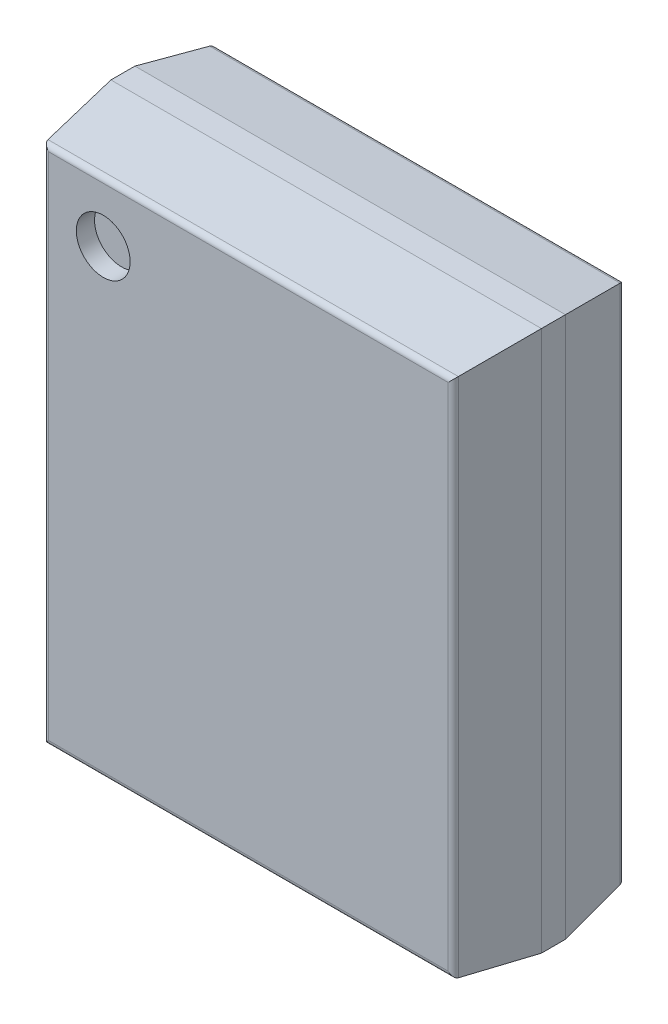
ISO-10303-21;
HEADER;
FILE_DESCRIPTION(('STEP AP214'),'2;1');
FILE_NAME('part.step','',(''),(''),'','','');
FILE_SCHEMA(('AUTOMOTIVE_DESIGN { 1 0 10303 214 1 1 1 1 }'));
ENDSEC;
DATA;
#1=APPLICATION_CONTEXT('core data for automotive mechanical design processes');
#2=APPLICATION_PROTOCOL_DEFINITION('international standard','automotive_design',2000,#1);
#3=PRODUCT_CONTEXT('',#1,'mechanical');
#4=PRODUCT('Part','Part','',(#3));
#5=PRODUCT_RELATED_PRODUCT_CATEGORY('part','',(#4));
#6=PRODUCT_DEFINITION_FORMATION('','',#4);
#7=PRODUCT_DEFINITION_CONTEXT('part definition',#1,'design');
#8=PRODUCT_DEFINITION('design','',#6,#7);
#9=PRODUCT_DEFINITION_SHAPE('','',#8);
#10=(LENGTH_UNIT() NAMED_UNIT(*) SI_UNIT(.MILLI.,.METRE.));
#11=(NAMED_UNIT(*) PLANE_ANGLE_UNIT() SI_UNIT($,.RADIAN.));
#12=(NAMED_UNIT(*) SI_UNIT($,.STERADIAN.) SOLID_ANGLE_UNIT());
#13=UNCERTAINTY_MEASURE_WITH_UNIT(LENGTH_MEASURE(1.E-05),#10,'distance_accuracy_value','');
#14=(GEOMETRIC_REPRESENTATION_CONTEXT(3) GLOBAL_UNCERTAINTY_ASSIGNED_CONTEXT((#13)) GLOBAL_UNIT_ASSIGNED_CONTEXT((#10,
#11,#12)) REPRESENTATION_CONTEXT('',''));
#15=CARTESIAN_POINT('',(0.,0.,0.));
#16=DIRECTION('',(0.,0.,1.));
#17=DIRECTION('',(1.,0.,0.));
#18=AXIS2_PLACEMENT_3D('',#15,#16,#17);
#19=CARTESIAN_POINT('',(-1.315,1.815,1.485));
#20=DIRECTION('',(0.,0.,1.));
#21=DIRECTION('',(1.,0.,0.));
#22=AXIS2_PLACEMENT_3D('',#19,#20,#21);
#23=PLANE('',#22);
#24=CARTESIAN_POINT('',(-1.315,1.815,1.485));
#25=DIRECTION('',(0.,0.,1.));
#26=DIRECTION('',(1.,0.,0.));
#27=AXIS2_PLACEMENT_3D('',#24,#25,#26);
#28=CIRCLE('',#27,0.24375);
#29=CARTESIAN_POINT('',(-1.07125,1.815,1.485));
#30=VERTEX_POINT('',#29);
#31=EDGE_CURVE('E11',#30,#30,#28,.T.);
#32=ORIENTED_EDGE('',*,*,#31,.T.);
#33=EDGE_LOOP('',(#32));
#34=FACE_BOUND('',#33,.T.);
#35=ADVANCED_FACE('F17',(#34),#23,.T.);
#36=CARTESIAN_POINT('',(-1.315,1.815,1.485));
#37=DIRECTION('',(0.,0.,1.));
#38=DIRECTION('',(1.,0.,0.));
#39=AXIS2_PLACEMENT_3D('',#36,#37,#38);
#40=CYLINDRICAL_SURFACE('',#39,0.24375);
#41=DIRECTION('',(0.,0.,1.));
#42=VECTOR('',#41,1.);
#43=CARTESIAN_POINT('',(-1.07125,1.815,1.485));
#44=LINE('',#43,#42);
#45=CARTESIAN_POINT('',(-1.07125,1.815,1.65));
#46=VERTEX_POINT('',#45);
#47=EDGE_CURVE('E20',#30,#46,#44,.T.);
#48=ORIENTED_EDGE('',*,*,#47,.T.);
#49=CARTESIAN_POINT('',(-1.315,1.815,1.65));
#50=DIRECTION('',(0.,0.,1.));
#51=DIRECTION('',(1.,0.,0.));
#52=AXIS2_PLACEMENT_3D('',#49,#50,#51);
#53=CIRCLE('',#52,0.24375);
#54=EDGE_CURVE('E199',#46,#46,#53,.T.);
#55=ORIENTED_EDGE('',*,*,#54,.T.);
#56=ORIENTED_EDGE('',*,*,#47,.F.);
#57=ORIENTED_EDGE('',*,*,#31,.F.);
#58=EDGE_LOOP('',(#48,#55,#56,#57));
#59=FACE_BOUND('',#58,.T.);
#60=ADVANCED_FACE('F394',(#59),#40,.F.);
#61=CARTESIAN_POINT('',(1.808944484583,-2.3525,1.6));
#62=DIRECTION('',(0.,1.,0.));
#63=DIRECTION('',(0.,0.,1.));
#64=AXIS2_PLACEMENT_3D('',#61,#62,#63);
#65=CYLINDRICAL_SURFACE('',#64,0.05);
#66=CARTESIAN_POINT('',(1.808944484583,-2.308944484583,1.6));
#67=DIRECTION('',(-0.707106781186548,-0.707106781186548,0.));
#68=DIRECTION('',(0.707106781186548,-0.707106781186548,0.));
#69=AXIS2_PLACEMENT_3D('',#66,#67,#68);
#70=ELLIPSE('',#69,0.07071067811865,0.05);
#71=CARTESIAN_POINT('',(1.85847222397,-2.35847222397,1.606855875671));
#72=VERTEX_POINT('',#71);
#73=CARTESIAN_POINT('',(1.808944484583,-2.308944484583,1.65));
#74=VERTEX_POINT('',#73);
#75=EDGE_CURVE('E297',#72,#74,#70,.T.);
#76=ORIENTED_EDGE('',*,*,#75,.F.);
#77=DIRECTION('',(0.,1.,0.));
#78=VECTOR('',#77,1.);
#79=CARTESIAN_POINT('',(1.85847222397,-2.3525,1.606855875671));
#80=LINE('',#79,#78);
#81=CARTESIAN_POINT('',(1.85847222397,2.35847222397,1.606855875671));
#82=VERTEX_POINT('',#81);
#83=EDGE_CURVE('E293',#72,#82,#80,.T.);
#84=ORIENTED_EDGE('',*,*,#83,.T.);
#85=CARTESIAN_POINT('',(1.808944484583,2.308944484583,1.6));
#86=DIRECTION('',(-0.707106781186548,0.707106781186548,0.));
#87=DIRECTION('',(0.707106781186548,0.707106781186548,0.));
#88=AXIS2_PLACEMENT_3D('',#85,#86,#87);
#89=ELLIPSE('',#88,0.07071067811865,0.05);
#90=CARTESIAN_POINT('',(1.808944484583,2.308944484583,1.65));
#91=VERTEX_POINT('',#90);
#92=EDGE_CURVE('E202',#91,#82,#89,.T.);
#93=ORIENTED_EDGE('',*,*,#92,.F.);
#94=DIRECTION('',(0.,1.,0.));
#95=VECTOR('',#94,1.);
#96=CARTESIAN_POINT('',(1.808944484583,-2.3525,1.65));
#97=LINE('',#96,#95);
#98=EDGE_CURVE('E305',#74,#91,#97,.T.);
#99=ORIENTED_EDGE('',*,*,#98,.F.);
#100=EDGE_LOOP('',(#76,#84,#93,#99));
#101=FACE_BOUND('',#100,.T.);
#102=ADVANCED_FACE('F319',(#101),#65,.T.);
#103=CARTESIAN_POINT('',(-1.8525,2.308944484583,1.6));
#104=DIRECTION('',(1.,0.,0.));
#105=DIRECTION('',(0.,0.,1.));
#106=AXIS2_PLACEMENT_3D('',#103,#104,#105);
#107=CYLINDRICAL_SURFACE('',#106,0.05);
#108=DIRECTION('',(1.,0.,0.));
#109=VECTOR('',#108,1.);
#110=CARTESIAN_POINT('',(-1.8525,2.308944484583,1.65));
#111=LINE('',#110,#109);
#112=CARTESIAN_POINT('',(-1.808944484583,2.308944484583,1.65));
#113=VERTEX_POINT('',#112);
#114=EDGE_CURVE('E203',#113,#91,#111,.T.);
#115=ORIENTED_EDGE('',*,*,#114,.T.);
#116=ORIENTED_EDGE('',*,*,#92,.T.);
#117=DIRECTION('',(1.,0.,0.));
#118=VECTOR('',#117,1.);
#119=CARTESIAN_POINT('',(-1.8525,2.35847222397,1.606855875671));
#120=LINE('',#119,#118);
#121=CARTESIAN_POINT('',(-1.85847222397,2.35847222397,1.606855875671));
#122=VERTEX_POINT('',#121);
#123=EDGE_CURVE('E288',#122,#82,#120,.T.);
#124=ORIENTED_EDGE('',*,*,#123,.F.);
#125=CARTESIAN_POINT('',(-1.808944484583,2.308944484583,1.6));
#126=DIRECTION('',(0.707106781186548,0.707106781186548,0.));
#127=DIRECTION('',(-0.707106781186548,0.707106781186548,0.));
#128=AXIS2_PLACEMENT_3D('',#125,#126,#127);
#129=ELLIPSE('',#128,0.07071067811865,0.05);
#130=EDGE_CURVE('E283',#122,#113,#129,.T.);
#131=ORIENTED_EDGE('',*,*,#130,.T.);
#132=EDGE_LOOP('',(#115,#116,#124,#131));
#133=FACE_BOUND('',#132,.T.);
#134=ADVANCED_FACE('F313',(#133),#107,.T.);
#135=CARTESIAN_POINT('',(-1.95,-2.45,1.65));
#136=DIRECTION('',(0.,0.,1.));
#137=DIRECTION('',(1.,0.,0.));
#138=AXIS2_PLACEMENT_3D('',#135,#136,#137);
#139=PLANE('',#138);
#140=ORIENTED_EDGE('',*,*,#54,.F.);
#141=EDGE_LOOP('',(#140));
#142=FACE_BOUND('',#141,.T.);
#143=DIRECTION('',(0.,1.,0.));
#144=VECTOR('',#143,1.);
#145=CARTESIAN_POINT('',(-1.808944484583,-2.3525,1.65));
#146=LINE('',#145,#144);
#147=CARTESIAN_POINT('',(-1.808944484583,-2.308944484583,1.65));
#148=VERTEX_POINT('',#147);
#149=EDGE_CURVE('E280',#148,#113,#146,.T.);
#150=ORIENTED_EDGE('',*,*,#149,.F.);
#151=DIRECTION('',(1.,0.,0.));
#152=VECTOR('',#151,1.);
#153=CARTESIAN_POINT('',(-1.8525,-2.308944484583,1.65));
#154=LINE('',#153,#152);
#155=EDGE_CURVE('E301',#148,#74,#154,.T.);
#156=ORIENTED_EDGE('',*,*,#155,.T.);
#157=ORIENTED_EDGE('',*,*,#98,.T.);
#158=ORIENTED_EDGE('',*,*,#114,.F.);
#159=EDGE_LOOP('',(#150,#156,#157,#158));
#160=FACE_BOUND('',#159,.T.);
#161=ADVANCED_FACE('F317',(#142,#160),#139,.T.);
#162=CARTESIAN_POINT('',(-1.8525,-2.308944484583,1.6));
#163=DIRECTION('',(1.,0.,0.));
#164=DIRECTION('',(0.,-0.990554787738321,0.137117513428044));
#165=AXIS2_PLACEMENT_3D('',#162,#163,#164);
#166=CYLINDRICAL_SURFACE('',#165,0.05);
#167=DIRECTION('',(1.,0.,0.));
#168=VECTOR('',#167,1.);
#169=CARTESIAN_POINT('',(-1.8525,-2.35847222397,1.606855875671));
#170=LINE('',#169,#168);
#171=CARTESIAN_POINT('',(-1.85847222397,-2.35847222397,1.606855875671));
#172=VERTEX_POINT('',#171);
#173=EDGE_CURVE('E225',#172,#72,#170,.T.);
#174=ORIENTED_EDGE('',*,*,#173,.T.);
#175=ORIENTED_EDGE('',*,*,#75,.T.);
#176=ORIENTED_EDGE('',*,*,#155,.F.);
#177=CARTESIAN_POINT('',(-1.808944484583,-2.308944484583,1.6));
#178=DIRECTION('',(-0.707106781186548,0.707106781186548,0.));
#179=DIRECTION('',(0.707106781186548,0.707106781186548,0.));
#180=AXIS2_PLACEMENT_3D('',#177,#178,#179);
#181=ELLIPSE('',#180,0.07071067811865,0.05);
#182=EDGE_CURVE('E229',#172,#148,#181,.T.);
#183=ORIENTED_EDGE('',*,*,#182,.F.);
#184=EDGE_LOOP('',(#174,#175,#176,#183));
#185=FACE_BOUND('',#184,.T.);
#186=ADVANCED_FACE('F328',(#185),#166,.T.);
#187=CARTESIAN_POINT('',(1.90125,-2.45,1.297823646339));
#188=DIRECTION('',(0.990554787738321,0.,0.137117513428044));
#189=DIRECTION('',(0.,-1.,0.));
#190=AXIS2_PLACEMENT_3D('',#187,#188,#189);
#191=PLANE('',#190);
#192=DIRECTION('',(-0.135846421408054,0.135846421408054,0.98137225331739));
#193=VECTOR('',#192,1.);
#194=CARTESIAN_POINT('',(1.86616385679,-2.36616385679,1.551290517721));
#195=LINE('',#194,#193);
#196=CARTESIAN_POINT('',(1.95,-2.45,0.945647292679));
#197=VERTEX_POINT('',#196);
#198=EDGE_CURVE('E230',#197,#72,#195,.T.);
#199=ORIENTED_EDGE('',*,*,#198,.F.);
#200=DIRECTION('',(0.,1.,0.));
#201=VECTOR('',#200,1.);
#202=CARTESIAN_POINT('',(1.95,-2.45,0.945647292679));
#203=LINE('',#202,#201);
#204=CARTESIAN_POINT('',(1.95,2.45,0.945647292679));
#205=VERTEX_POINT('',#204);
#206=EDGE_CURVE('E154',#197,#205,#203,.T.);
#207=ORIENTED_EDGE('',*,*,#206,.T.);
#208=DIRECTION('',(-0.135846421408054,-0.135846421408054,0.98137225331739));
#209=VECTOR('',#208,1.);
#210=CARTESIAN_POINT('',(1.820950943777,2.320950943777,1.877914493992));
#211=LINE('',#210,#209);
#212=EDGE_CURVE('E148',#205,#82,#211,.T.);
#213=ORIENTED_EDGE('',*,*,#212,.T.);
#214=ORIENTED_EDGE('',*,*,#83,.F.);
#215=EDGE_LOOP('',(#199,#207,#213,#214));
#216=FACE_BOUND('',#215,.T.);
#217=ADVANCED_FACE('F322',(#216),#191,.T.);
#218=CARTESIAN_POINT('',(-1.95,2.40125,1.297823646339));
#219=DIRECTION('',(0.,0.990554787738321,0.137117513428044));
#220=DIRECTION('',(1.,0.,0.));
#221=AXIS2_PLACEMENT_3D('',#218,#219,#220);
#222=PLANE('',#221);
#223=ORIENTED_EDGE('',*,*,#123,.T.);
#224=ORIENTED_EDGE('',*,*,#212,.F.);
#225=DIRECTION('',(1.,0.,0.));
#226=VECTOR('',#225,1.);
#227=CARTESIAN_POINT('',(-1.95,2.45,0.945647292679));
#228=LINE('',#227,#226);
#229=CARTESIAN_POINT('',(-1.95,2.45,0.945647292679));
#230=VERTEX_POINT('',#229);
#231=EDGE_CURVE('E141',#230,#205,#228,.T.);
#232=ORIENTED_EDGE('',*,*,#231,.F.);
#233=DIRECTION('',(0.135846421408054,-0.135846421408054,0.98137225331739));
#234=VECTOR('',#233,1.);
#235=CARTESIAN_POINT('',(-1.856936731685,2.356936731685,1.617948472062));
#236=LINE('',#235,#234);
#237=EDGE_CURVE('E145',#230,#122,#236,.T.);
#238=ORIENTED_EDGE('',*,*,#237,.T.);
#239=EDGE_LOOP('',(#223,#224,#232,#238));
#240=FACE_BOUND('',#239,.T.);
#241=ADVANCED_FACE('F144',(#240),#222,.T.);
#242=CARTESIAN_POINT('',(-1.808944484583,-2.3525,1.6));
#243=DIRECTION('',(0.,1.,0.));
#244=DIRECTION('',(-0.990554787738321,0.,0.137117513428044));
#245=AXIS2_PLACEMENT_3D('',#242,#243,#244);
#246=CYLINDRICAL_SURFACE('',#245,0.05);
#247=ORIENTED_EDGE('',*,*,#182,.T.);
#248=ORIENTED_EDGE('',*,*,#149,.T.);
#249=ORIENTED_EDGE('',*,*,#130,.F.);
#250=DIRECTION('',(0.,1.,0.));
#251=VECTOR('',#250,1.);
#252=CARTESIAN_POINT('',(-1.85847222397,-2.3525,1.606855875671));
#253=LINE('',#252,#251);
#254=EDGE_CURVE('E164',#172,#122,#253,.T.);
#255=ORIENTED_EDGE('',*,*,#254,.F.);
#256=EDGE_LOOP('',(#247,#248,#249,#255));
#257=FACE_BOUND('',#256,.T.);
#258=ADVANCED_FACE('F325',(#257),#246,.T.);
#259=CARTESIAN_POINT('',(-1.95,-2.40125,1.297823646339));
#260=DIRECTION('',(0.,0.990554787738321,-0.137117513428044));
#261=DIRECTION('',(-1.,0.,0.));
#262=AXIS2_PLACEMENT_3D('',#259,#260,#261);
#263=PLANE('',#262);
#264=DIRECTION('',(0.135846421408054,0.135846421408054,0.98137225331739));
#265=VECTOR('',#264,1.);
#266=CARTESIAN_POINT('',(-1.902149644698,-2.402149644698,1.291324495791));
#267=LINE('',#266,#265);
#268=CARTESIAN_POINT('',(-1.95,-2.45,0.945647292679));
#269=VERTEX_POINT('',#268);
#270=EDGE_CURVE('E166',#269,#172,#267,.T.);
#271=ORIENTED_EDGE('',*,*,#270,.F.);
#272=DIRECTION('',(1.,0.,0.));
#273=VECTOR('',#272,1.);
#274=CARTESIAN_POINT('',(-1.95,-2.45,0.945647292679));
#275=LINE('',#274,#273);
#276=EDGE_CURVE('E254',#269,#197,#275,.T.);
#277=ORIENTED_EDGE('',*,*,#276,.T.);
#278=ORIENTED_EDGE('',*,*,#198,.T.);
#279=ORIENTED_EDGE('',*,*,#173,.F.);
#280=EDGE_LOOP('',(#271,#277,#278,#279));
#281=FACE_BOUND('',#280,.T.);
#282=ADVANCED_FACE('F330',(#281),#263,.F.);
#283=CARTESIAN_POINT('',(1.95,-2.45,0.1));
#284=DIRECTION('',(1.,0.,0.));
#285=DIRECTION('',(0.,1.,0.));
#286=AXIS2_PLACEMENT_3D('',#283,#284,#285);
#287=PLANE('',#286);
#288=DIRECTION('',(0.,0.,1.));
#289=VECTOR('',#288,1.);
#290=CARTESIAN_POINT('',(1.95,-2.45,0.1));
#291=LINE('',#290,#289);
#292=CARTESIAN_POINT('',(1.95,-2.45,0.728147292679));
#293=VERTEX_POINT('',#292);
#294=EDGE_CURVE('E218',#293,#197,#291,.T.);
#295=ORIENTED_EDGE('',*,*,#294,.F.);
#296=DIRECTION('',(0.,1.,0.));
#297=VECTOR('',#296,1.);
#298=CARTESIAN_POINT('',(1.95,-2.45,0.728147292679));
#299=LINE('',#298,#297);
#300=CARTESIAN_POINT('',(1.95,2.45,0.728147292679));
#301=VERTEX_POINT('',#300);
#302=EDGE_CURVE('E217',#293,#301,#299,.T.);
#303=ORIENTED_EDGE('',*,*,#302,.T.);
#304=DIRECTION('',(0.,0.,1.));
#305=VECTOR('',#304,1.);
#306=CARTESIAN_POINT('',(1.95,2.45,0.1));
#307=LINE('',#306,#305);
#308=EDGE_CURVE('E155',#301,#205,#307,.T.);
#309=ORIENTED_EDGE('',*,*,#308,.T.);
#310=ORIENTED_EDGE('',*,*,#206,.F.);
#311=EDGE_LOOP('',(#295,#303,#309,#310));
#312=FACE_BOUND('',#311,.T.);
#313=ADVANCED_FACE('F335',(#312),#287,.T.);
#314=CARTESIAN_POINT('',(1.809662184836,-2.3525,0.15));
#315=DIRECTION('',(0.,1.,0.));
#316=DIRECTION('',(0.,0.,-1.));
#317=AXIS2_PLACEMENT_3D('',#314,#315,#316);
#318=CYLINDRICAL_SURFACE('',#317,0.05);
#319=DIRECTION('',(0.,1.,0.));
#320=VECTOR('',#319,1.);
#321=CARTESIAN_POINT('',(1.809662184836,-2.3525,0.1));
#322=LINE('',#321,#320);
#323=CARTESIAN_POINT('',(1.809662184836,-2.309662184836,0.1));
#324=VERTEX_POINT('',#323);
#325=CARTESIAN_POINT('',(1.809662184836,2.309662184836,0.1));
#326=VERTEX_POINT('',#325);
#327=EDGE_CURVE('E262',#324,#326,#322,.T.);
#328=ORIENTED_EDGE('',*,*,#327,.T.);
#329=CARTESIAN_POINT('',(1.809662184836,2.309662184836,0.15));
#330=DIRECTION('',(0.707106781186548,-0.707106781186548,0.));
#331=DIRECTION('',(0.707106781186548,0.707106781186548,0.));
#332=AXIS2_PLACEMENT_3D('',#329,#330,#331);
#333=ELLIPSE('',#332,0.07071067811865,0.05);
#334=CARTESIAN_POINT('',(1.859070535888,2.359070535888,0.142330916198));
#335=VERTEX_POINT('',#334);
#336=EDGE_CURVE('E236',#326,#335,#333,.T.);
#337=ORIENTED_EDGE('',*,*,#336,.T.);
#338=DIRECTION('',(0.,1.,0.));
#339=VECTOR('',#338,1.);
#340=CARTESIAN_POINT('',(1.859070535888,-2.3525,0.142330916198));
#341=LINE('',#340,#339);
#342=CARTESIAN_POINT('',(1.859070535888,-2.359070535888,0.142330916198));
#343=VERTEX_POINT('',#342);
#344=EDGE_CURVE('E213',#343,#335,#341,.T.);
#345=ORIENTED_EDGE('',*,*,#344,.F.);
#346=CARTESIAN_POINT('',(1.809662184836,-2.309662184836,0.15));
#347=DIRECTION('',(0.707106781186548,0.707106781186548,0.));
#348=DIRECTION('',(0.707106781186548,-0.707106781186548,0.));
#349=AXIS2_PLACEMENT_3D('',#346,#347,#348);
#350=ELLIPSE('',#349,0.07071067811865,0.05);
#351=EDGE_CURVE('E248',#343,#324,#350,.T.);
#352=ORIENTED_EDGE('',*,*,#351,.T.);
#353=EDGE_LOOP('',(#328,#337,#345,#352));
#354=FACE_BOUND('',#353,.T.);
#355=ADVANCED_FACE('F418',(#354),#318,.T.);
#356=CARTESIAN_POINT('',(-1.95,2.45,0.1));
#357=DIRECTION('',(0.,1.,0.));
#358=DIRECTION('',(1.,0.,0.));
#359=AXIS2_PLACEMENT_3D('',#356,#357,#358);
#360=PLANE('',#359);
#361=ORIENTED_EDGE('',*,*,#308,.F.);
#362=DIRECTION('',(1.,0.,0.));
#363=VECTOR('',#362,1.);
#364=CARTESIAN_POINT('',(-1.95,2.45,0.728147292679));
#365=LINE('',#364,#363);
#366=CARTESIAN_POINT('',(-1.95,2.45,0.728147292679));
#367=VERTEX_POINT('',#366);
#368=EDGE_CURVE('E172',#367,#301,#365,.T.);
#369=ORIENTED_EDGE('',*,*,#368,.F.);
#370=DIRECTION('',(0.,0.,1.));
#371=VECTOR('',#370,1.);
#372=CARTESIAN_POINT('',(-1.95,2.45,0.1));
#373=LINE('',#372,#371);
#374=EDGE_CURVE('E169',#367,#230,#373,.T.);
#375=ORIENTED_EDGE('',*,*,#374,.T.);
#376=ORIENTED_EDGE('',*,*,#231,.T.);
#377=EDGE_LOOP('',(#361,#369,#375,#376));
#378=FACE_BOUND('',#377,.T.);
#379=ADVANCED_FACE('F170',(#378),#360,.T.);
#380=CARTESIAN_POINT('',(-1.90125,-2.45,1.297823646339));
#381=DIRECTION('',(0.990554787738321,0.,-0.137117513428044));
#382=DIRECTION('',(0.,-1.,0.));
#383=AXIS2_PLACEMENT_3D('',#380,#381,#382);
#384=PLANE('',#383);
#385=ORIENTED_EDGE('',*,*,#254,.T.);
#386=ORIENTED_EDGE('',*,*,#237,.F.);
#387=DIRECTION('',(0.,1.,0.));
#388=VECTOR('',#387,1.);
#389=CARTESIAN_POINT('',(-1.95,-2.45,0.945647292679));
#390=LINE('',#389,#388);
#391=EDGE_CURVE('E162',#269,#230,#390,.T.);
#392=ORIENTED_EDGE('',*,*,#391,.F.);
#393=ORIENTED_EDGE('',*,*,#270,.T.);
#394=EDGE_LOOP('',(#385,#386,#392,#393));
#395=FACE_BOUND('',#394,.T.);
#396=ADVANCED_FACE('F159',(#395),#384,.F.);
#397=CARTESIAN_POINT('',(-1.8525,2.309662184836,0.15));
#398=DIRECTION('',(1.,0.,0.));
#399=DIRECTION('',(0.,0.,-1.));
#400=AXIS2_PLACEMENT_3D('',#397,#398,#399);
#401=CYLINDRICAL_SURFACE('',#400,0.05);
#402=CARTESIAN_POINT('',(-1.809662184836,2.309662184836,0.15));
#403=DIRECTION('',(-0.707106781186548,-0.707106781186548,0.));
#404=DIRECTION('',(-0.707106781186548,0.707106781186548,0.));
#405=AXIS2_PLACEMENT_3D('',#402,#403,#404);
#406=ELLIPSE('',#405,0.07071067811865,0.05);
#407=CARTESIAN_POINT('',(-1.859070535888,2.359070535888,0.142330916198));
#408=VERTEX_POINT('',#407);
#409=CARTESIAN_POINT('',(-1.809662184836,2.309662184836,0.1));
#410=VERTEX_POINT('',#409);
#411=EDGE_CURVE('E204',#408,#410,#406,.T.);
#412=ORIENTED_EDGE('',*,*,#411,.F.);
#413=DIRECTION('',(1.,0.,0.));
#414=VECTOR('',#413,1.);
#415=CARTESIAN_POINT('',(-1.8525,2.359070535888,0.142330916198));
#416=LINE('',#415,#414);
#417=EDGE_CURVE('E243',#408,#335,#416,.T.);
#418=ORIENTED_EDGE('',*,*,#417,.T.);
#419=ORIENTED_EDGE('',*,*,#336,.F.);
#420=DIRECTION('',(1.,0.,0.));
#421=VECTOR('',#420,1.);
#422=CARTESIAN_POINT('',(-1.8525,2.309662184836,0.1));
#423=LINE('',#422,#421);
#424=EDGE_CURVE('E261',#410,#326,#423,.T.);
#425=ORIENTED_EDGE('',*,*,#424,.F.);
#426=EDGE_LOOP('',(#412,#418,#419,#425));
#427=FACE_BOUND('',#426,.T.);
#428=ADVANCED_FACE('F380',(#427),#401,.T.);
#429=CARTESIAN_POINT('',(-1.95,-2.45,0.1));
#430=DIRECTION('',(0.,0.,1.));
#431=DIRECTION('',(1.,0.,0.));
#432=AXIS2_PLACEMENT_3D('',#429,#430,#431);
#433=PLANE('',#432);
#434=ORIENTED_EDGE('',*,*,#424,.T.);
#435=ORIENTED_EDGE('',*,*,#327,.F.);
#436=DIRECTION('',(1.,0.,0.));
#437=VECTOR('',#436,1.);
#438=CARTESIAN_POINT('',(-1.8525,-2.309662184836,0.1));
#439=LINE('',#438,#437);
#440=CARTESIAN_POINT('',(-1.809662184836,-2.309662184836,0.1));
#441=VERTEX_POINT('',#440);
#442=EDGE_CURVE('E244',#441,#324,#439,.T.);
#443=ORIENTED_EDGE('',*,*,#442,.F.);
#444=DIRECTION('',(0.,1.,0.));
#445=VECTOR('',#444,1.);
#446=CARTESIAN_POINT('',(-1.809662184836,-2.3525,0.1));
#447=LINE('',#446,#445);
#448=EDGE_CURVE('E189',#441,#410,#447,.T.);
#449=ORIENTED_EDGE('',*,*,#448,.T.);
#450=EDGE_LOOP('',(#434,#435,#443,#449));
#451=FACE_BOUND('',#450,.T.);
#452=ADVANCED_FACE('F428',(#451),#433,.F.);
#453=CARTESIAN_POINT('',(1.90125,-2.45,0.414073646339));
#454=DIRECTION('',(-0.988167021032104,0.,0.153381676039016));
#455=DIRECTION('',(0.,1.,0.));
#456=AXIS2_PLACEMENT_3D('',#453,#454,#455);
#457=PLANE('',#456);
#458=ORIENTED_EDGE('',*,*,#344,.T.);
#459=DIRECTION('',(-0.151608675110006,-0.151608675110006,-0.976744398122036));
#460=VECTOR('',#459,1.);
#461=CARTESIAN_POINT('',(1.801235690409,2.301235690409,-0.230272177239));
#462=LINE('',#461,#460);
#463=EDGE_CURVE('E239',#301,#335,#462,.T.);
#464=ORIENTED_EDGE('',*,*,#463,.F.);
#465=ORIENTED_EDGE('',*,*,#302,.F.);
#466=DIRECTION('',(-0.151608675110006,0.151608675110006,-0.976744398122036));
#467=VECTOR('',#466,1.);
#468=CARTESIAN_POINT('',(1.857549406812,-2.357549406812,0.132530986856));
#469=LINE('',#468,#467);
#470=EDGE_CURVE('E212',#293,#343,#469,.T.);
#471=ORIENTED_EDGE('',*,*,#470,.T.);
#472=EDGE_LOOP('',(#458,#464,#465,#471));
#473=FACE_BOUND('',#472,.T.);
#474=ADVANCED_FACE('F345',(#473),#457,.F.);
#475=CARTESIAN_POINT('',(-1.95,-2.45,0.1));
#476=DIRECTION('',(0.,1.,0.));
#477=DIRECTION('',(1.,0.,0.));
#478=AXIS2_PLACEMENT_3D('',#475,#476,#477);
#479=PLANE('',#478);
#480=ORIENTED_EDGE('',*,*,#276,.F.);
#481=DIRECTION('',(0.,0.,1.));
#482=VECTOR('',#481,1.);
#483=CARTESIAN_POINT('',(-1.95,-2.45,0.1));
#484=LINE('',#483,#482);
#485=CARTESIAN_POINT('',(-1.95,-2.45,0.728147292679));
#486=VERTEX_POINT('',#485);
#487=EDGE_CURVE('E177',#486,#269,#484,.T.);
#488=ORIENTED_EDGE('',*,*,#487,.F.);
#489=DIRECTION('',(1.,0.,0.));
#490=VECTOR('',#489,1.);
#491=CARTESIAN_POINT('',(-1.95,-2.45,0.728147292679));
#492=LINE('',#491,#490);
#493=EDGE_CURVE('E208',#486,#293,#492,.T.);
#494=ORIENTED_EDGE('',*,*,#493,.T.);
#495=ORIENTED_EDGE('',*,*,#294,.T.);
#496=EDGE_LOOP('',(#480,#488,#494,#495));
#497=FACE_BOUND('',#496,.T.);
#498=ADVANCED_FACE('F337',(#497),#479,.F.);
#499=CARTESIAN_POINT('',(-1.8525,-2.309662184836,0.15));
#500=DIRECTION('',(1.,0.,0.));
#501=DIRECTION('',(0.,-0.988167021032104,-0.153381676039016));
#502=AXIS2_PLACEMENT_3D('',#499,#500,#501);
#503=CYLINDRICAL_SURFACE('',#502,0.05);
#504=CARTESIAN_POINT('',(-1.809662184836,-2.309662184836,0.15));
#505=DIRECTION('',(0.707106781186548,-0.707106781186548,0.));
#506=DIRECTION('',(0.707106781186548,0.707106781186548,0.));
#507=AXIS2_PLACEMENT_3D('',#504,#505,#506);
#508=ELLIPSE('',#507,0.07071067811865,0.05);
#509=CARTESIAN_POINT('',(-1.859070535888,-2.359070535888,0.142330916198));
#510=VERTEX_POINT('',#509);
#511=EDGE_CURVE('E182',#510,#441,#508,.T.);
#512=ORIENTED_EDGE('',*,*,#511,.T.);
#513=ORIENTED_EDGE('',*,*,#442,.T.);
#514=ORIENTED_EDGE('',*,*,#351,.F.);
#515=DIRECTION('',(1.,0.,0.));
#516=VECTOR('',#515,1.);
#517=CARTESIAN_POINT('',(-1.8525,-2.359070535888,0.142330916198));
#518=LINE('',#517,#516);
#519=EDGE_CURVE('E198',#510,#343,#518,.T.);
#520=ORIENTED_EDGE('',*,*,#519,.F.);
#521=EDGE_LOOP('',(#512,#513,#514,#520));
#522=FACE_BOUND('',#521,.T.);
#523=ADVANCED_FACE('F438',(#522),#503,.T.);
#524=CARTESIAN_POINT('',(-1.95,2.40125,0.414073646339));
#525=DIRECTION('',(0.,-0.988167021032104,0.153381676039016));
#526=DIRECTION('',(-1.,0.,0.));
#527=AXIS2_PLACEMENT_3D('',#524,#525,#526);
#528=PLANE('',#527);
#529=DIRECTION('',(0.151608675110006,-0.151608675110006,-0.976744398122036));
#530=VECTOR('',#529,1.);
#531=CARTESIAN_POINT('',(-1.846056811627,2.346056811627,0.05848952479572));
#532=LINE('',#531,#530);
#533=EDGE_CURVE('E193',#367,#408,#532,.T.);
#534=ORIENTED_EDGE('',*,*,#533,.F.);
#535=ORIENTED_EDGE('',*,*,#368,.T.);
#536=ORIENTED_EDGE('',*,*,#463,.T.);
#537=ORIENTED_EDGE('',*,*,#417,.F.);
#538=EDGE_LOOP('',(#534,#535,#536,#537));
#539=FACE_BOUND('',#538,.T.);
#540=ADVANCED_FACE('F349',(#539),#528,.F.);
#541=CARTESIAN_POINT('',(-1.95,-2.45,0.1));
#542=DIRECTION('',(1.,0.,0.));
#543=DIRECTION('',(0.,1.,0.));
#544=AXIS2_PLACEMENT_3D('',#541,#542,#543);
#545=PLANE('',#544);
#546=ORIENTED_EDGE('',*,*,#391,.T.);
#547=ORIENTED_EDGE('',*,*,#374,.F.);
#548=DIRECTION('',(0.,1.,0.));
#549=VECTOR('',#548,1.);
#550=CARTESIAN_POINT('',(-1.95,-2.45,0.728147292679));
#551=LINE('',#550,#549);
#552=EDGE_CURVE('E357',#486,#367,#551,.T.);
#553=ORIENTED_EDGE('',*,*,#552,.F.);
#554=ORIENTED_EDGE('',*,*,#487,.T.);
#555=EDGE_LOOP('',(#546,#547,#553,#554));
#556=FACE_BOUND('',#555,.T.);
#557=ADVANCED_FACE('F180',(#556),#545,.F.);
#558=CARTESIAN_POINT('',(-1.809662184836,-2.3525,0.15));
#559=DIRECTION('',(0.,1.,0.));
#560=DIRECTION('',(-0.988167021032104,0.,-0.153381676039016));
#561=AXIS2_PLACEMENT_3D('',#558,#559,#560);
#562=CYLINDRICAL_SURFACE('',#561,0.05);
#563=DIRECTION('',(0.,1.,0.));
#564=VECTOR('',#563,1.);
#565=CARTESIAN_POINT('',(-1.859070535888,-2.3525,0.142330916198));
#566=LINE('',#565,#564);
#567=EDGE_CURVE('E195',#510,#408,#566,.T.);
#568=ORIENTED_EDGE('',*,*,#567,.T.);
#569=ORIENTED_EDGE('',*,*,#411,.T.);
#570=ORIENTED_EDGE('',*,*,#448,.F.);
#571=ORIENTED_EDGE('',*,*,#511,.F.);
#572=EDGE_LOOP('',(#568,#569,#570,#571));
#573=FACE_BOUND('',#572,.T.);
#574=ADVANCED_FACE('F383',(#573),#562,.T.);
#575=CARTESIAN_POINT('',(-1.95,-2.40125,0.414073646339));
#576=DIRECTION('',(0.,-0.988167021032104,-0.153381676039016));
#577=DIRECTION('',(0.,0.153381676039016,-0.988167021032104));
#578=AXIS2_PLACEMENT_3D('',#575,#576,#577);
#579=PLANE('',#578);
#580=ORIENTED_EDGE('',*,*,#519,.T.);
#581=ORIENTED_EDGE('',*,*,#470,.F.);
#582=ORIENTED_EDGE('',*,*,#493,.F.);
#583=DIRECTION('',(0.151608675110006,0.151608675110006,-0.976744398122036));
#584=VECTOR('',#583,1.);
#585=CARTESIAN_POINT('',(-1.90237052803,-2.40237052803,0.42129268889));
#586=LINE('',#585,#584);
#587=EDGE_CURVE('E370',#486,#510,#586,.T.);
#588=ORIENTED_EDGE('',*,*,#587,.T.);
#589=EDGE_LOOP('',(#580,#581,#582,#588));
#590=FACE_BOUND('',#589,.T.);
#591=ADVANCED_FACE('F342',(#590),#579,.T.);
#592=CARTESIAN_POINT('',(-1.90125,-2.45,0.414073646339));
#593=DIRECTION('',(-0.988167021032104,0.,-0.153381676039016));
#594=DIRECTION('',(-0.153381676039016,0.,0.988167021032104));
#595=AXIS2_PLACEMENT_3D('',#592,#593,#594);
#596=PLANE('',#595);
#597=ORIENTED_EDGE('',*,*,#587,.F.);
#598=ORIENTED_EDGE('',*,*,#552,.T.);
#599=ORIENTED_EDGE('',*,*,#533,.T.);
#600=ORIENTED_EDGE('',*,*,#567,.F.);
#601=EDGE_LOOP('',(#597,#598,#599,#600));
#602=FACE_BOUND('',#601,.T.);
#603=ADVANCED_FACE('F384',(#602),#596,.T.);
#604=CLOSED_SHELL('',(#35,#60,#102,#134,#161,#186,#217,#241,#258,#282,#313,#355,#379,#396,#428,
#452,#474,#498,#523,#540,#557,#574,#591,#603));
#605=MANIFOLD_SOLID_BREP('B1',#604);
#606=ADVANCED_BREP_SHAPE_REPRESENTATION('',(#18,#605),#14);
#607=SHAPE_DEFINITION_REPRESENTATION(#9,#606);
ENDSEC;
END-ISO-10303-21;
